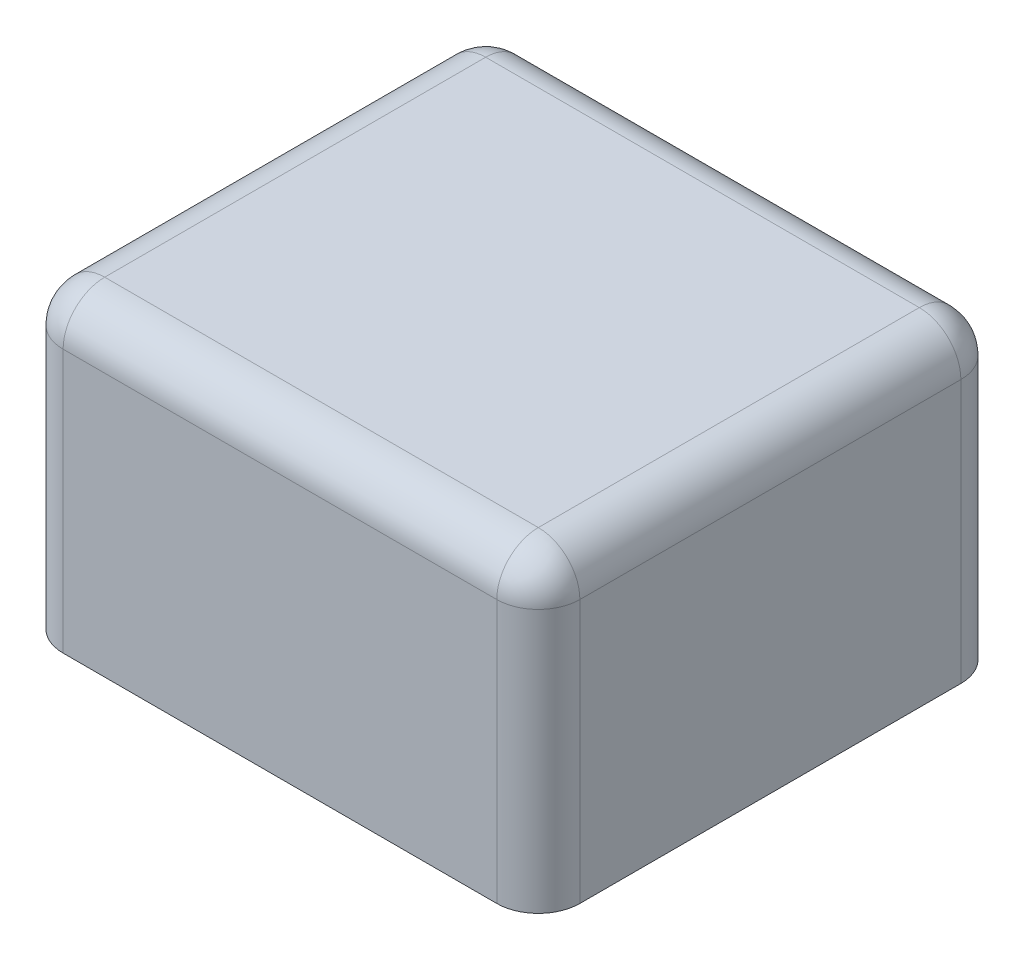
ISO-10303-21;
HEADER;
FILE_DESCRIPTION(('STEP AP214'),'2;1');
FILE_NAME('part.step','',(''),(''),'','','');
FILE_SCHEMA(('AUTOMOTIVE_DESIGN { 1 0 10303 214 1 1 1 1 }'));
ENDSEC;
DATA;
#1=APPLICATION_CONTEXT('core data for automotive mechanical design processes');
#2=APPLICATION_PROTOCOL_DEFINITION('international standard','automotive_design',2000,#1);
#3=PRODUCT_CONTEXT('',#1,'mechanical');
#4=PRODUCT('Part','Part','',(#3));
#5=PRODUCT_RELATED_PRODUCT_CATEGORY('part','',(#4));
#6=PRODUCT_DEFINITION_FORMATION('','',#4);
#7=PRODUCT_DEFINITION_CONTEXT('part definition',#1,'design');
#8=PRODUCT_DEFINITION('design','',#6,#7);
#9=PRODUCT_DEFINITION_SHAPE('','',#8);
#10=(LENGTH_UNIT() NAMED_UNIT(*) SI_UNIT(.MILLI.,.METRE.));
#11=(NAMED_UNIT(*) PLANE_ANGLE_UNIT() SI_UNIT($,.RADIAN.));
#12=(NAMED_UNIT(*) SI_UNIT($,.STERADIAN.) SOLID_ANGLE_UNIT());
#13=UNCERTAINTY_MEASURE_WITH_UNIT(LENGTH_MEASURE(1.E-05),#10,'distance_accuracy_value','');
#14=(GEOMETRIC_REPRESENTATION_CONTEXT(3) GLOBAL_UNCERTAINTY_ASSIGNED_CONTEXT((#13)) GLOBAL_UNIT_ASSIGNED_CONTEXT((#10,
#11,#12)) REPRESENTATION_CONTEXT('',''));
#15=CARTESIAN_POINT('',(0.,0.,0.));
#16=DIRECTION('',(0.,0.,1.));
#17=DIRECTION('',(1.,0.,0.));
#18=AXIS2_PLACEMENT_3D('',#15,#16,#17);
#19=CARTESIAN_POINT('',(18.65,22.,16.75));
#20=DIRECTION('',(-1.,0.,0.));
#21=DIRECTION('',(0.,0.,1.));
#22=AXIS2_PLACEMENT_3D('',#19,#20,#21);
#23=PLANE('',#22);
#24=DIRECTION('',(0.,0.,-1.));
#25=VECTOR('',#24,1.);
#26=CARTESIAN_POINT('',(18.65,0.,16.75));
#27=LINE('',#26,#25);
#28=CARTESIAN_POINT('',(18.65,0.,13.75));
#29=VERTEX_POINT('',#28);
#30=CARTESIAN_POINT('',(18.65,0.,-13.75));
#31=VERTEX_POINT('',#30);
#32=EDGE_CURVE('E142',#29,#31,#27,.T.);
#33=ORIENTED_EDGE('',*,*,#32,.T.);
#34=DIRECTION('',(0.,-1.,0.));
#35=VECTOR('',#34,1.);
#36=CARTESIAN_POINT('',(18.65,22.,-13.75));
#37=LINE('',#36,#35);
#38=CARTESIAN_POINT('',(18.65,19.,-13.75));
#39=VERTEX_POINT('',#38);
#40=EDGE_CURVE('E160',#31,#39,#37,.F.);
#41=ORIENTED_EDGE('',*,*,#40,.T.);
#42=DIRECTION('',(0.,0.,-1.));
#43=VECTOR('',#42,1.);
#44=CARTESIAN_POINT('',(18.65,19.,16.75));
#45=LINE('',#44,#43);
#46=CARTESIAN_POINT('',(18.65,19.,13.75));
#47=VERTEX_POINT('',#46);
#48=EDGE_CURVE('E156',#39,#47,#45,.F.);
#49=ORIENTED_EDGE('',*,*,#48,.T.);
#50=DIRECTION('',(0.,-1.,0.));
#51=VECTOR('',#50,1.);
#52=CARTESIAN_POINT('',(18.65,22.,13.75));
#53=LINE('',#52,#51);
#54=EDGE_CURVE('E158',#47,#29,#53,.T.);
#55=ORIENTED_EDGE('',*,*,#54,.T.);
#56=EDGE_LOOP('',(#33,#41,#49,#55));
#57=FACE_BOUND('',#56,.T.);
#58=ADVANCED_FACE('F33',(#57),#23,.F.);
#59=CARTESIAN_POINT('',(-18.65,22.,-16.75));
#60=DIRECTION('',(0.,0.,1.));
#61=DIRECTION('',(1.,0.,0.));
#62=AXIS2_PLACEMENT_3D('',#59,#60,#61);
#63=PLANE('',#62);
#64=DIRECTION('',(-1.,0.,0.));
#65=VECTOR('',#64,1.);
#66=CARTESIAN_POINT('',(-18.65,0.,-16.75));
#67=LINE('',#66,#65);
#68=CARTESIAN_POINT('',(15.65,0.,-16.75));
#69=VERTEX_POINT('',#68);
#70=CARTESIAN_POINT('',(-15.65,0.,-16.75));
#71=VERTEX_POINT('',#70);
#72=EDGE_CURVE('E138',#69,#71,#67,.T.);
#73=ORIENTED_EDGE('',*,*,#72,.T.);
#74=DIRECTION('',(0.,-1.,0.));
#75=VECTOR('',#74,1.);
#76=CARTESIAN_POINT('',(-15.65,22.,-16.75));
#77=LINE('',#76,#75);
#78=CARTESIAN_POINT('',(-15.65,19.,-16.75));
#79=VERTEX_POINT('',#78);
#80=EDGE_CURVE('E115',#71,#79,#77,.F.);
#81=ORIENTED_EDGE('',*,*,#80,.T.);
#82=DIRECTION('',(-1.,0.,0.));
#83=VECTOR('',#82,1.);
#84=CARTESIAN_POINT('',(-18.65,19.,-16.75));
#85=LINE('',#84,#83);
#86=CARTESIAN_POINT('',(15.65,19.,-16.75));
#87=VERTEX_POINT('',#86);
#88=EDGE_CURVE('E120',#79,#87,#85,.F.);
#89=ORIENTED_EDGE('',*,*,#88,.T.);
#90=DIRECTION('',(0.,-1.,0.));
#91=VECTOR('',#90,1.);
#92=CARTESIAN_POINT('',(15.65,22.,-16.75));
#93=LINE('',#92,#91);
#94=EDGE_CURVE('E153',#87,#69,#93,.T.);
#95=ORIENTED_EDGE('',*,*,#94,.T.);
#96=EDGE_LOOP('',(#73,#81,#89,#95));
#97=FACE_BOUND('',#96,.T.);
#98=ADVANCED_FACE('F249',(#97),#63,.F.);
#99=CARTESIAN_POINT('',(-18.65,22.,16.75));
#100=DIRECTION('',(1.,0.,0.));
#101=DIRECTION('',(0.,0.,-1.));
#102=AXIS2_PLACEMENT_3D('',#99,#100,#101);
#103=PLANE('',#102);
#104=DIRECTION('',(0.,0.,1.));
#105=VECTOR('',#104,1.);
#106=CARTESIAN_POINT('',(-18.65,19.,16.75));
#107=LINE('',#106,#105);
#108=CARTESIAN_POINT('',(-18.65,19.,13.75));
#109=VERTEX_POINT('',#108);
#110=CARTESIAN_POINT('',(-18.65,19.,-13.75));
#111=VERTEX_POINT('',#110);
#112=EDGE_CURVE('E129',#109,#111,#107,.F.);
#113=ORIENTED_EDGE('',*,*,#112,.T.);
#114=DIRECTION('',(0.,-1.,0.));
#115=VECTOR('',#114,1.);
#116=CARTESIAN_POINT('',(-18.65,22.,-13.75));
#117=LINE('',#116,#115);
#118=CARTESIAN_POINT('',(-18.65,0.,-13.75));
#119=VERTEX_POINT('',#118);
#120=EDGE_CURVE('E114',#111,#119,#117,.T.);
#121=ORIENTED_EDGE('',*,*,#120,.T.);
#122=DIRECTION('',(0.,0.,1.));
#123=VECTOR('',#122,1.);
#124=CARTESIAN_POINT('',(-18.65,0.,16.75));
#125=LINE('',#124,#123);
#126=CARTESIAN_POINT('',(-18.65,0.,13.75));
#127=VERTEX_POINT('',#126);
#128=EDGE_CURVE('E126',#119,#127,#125,.T.);
#129=ORIENTED_EDGE('',*,*,#128,.T.);
#130=DIRECTION('',(0.,-1.,0.));
#131=VECTOR('',#130,1.);
#132=CARTESIAN_POINT('',(-18.65,22.,13.75));
#133=LINE('',#132,#131);
#134=EDGE_CURVE('E132',#127,#109,#133,.F.);
#135=ORIENTED_EDGE('',*,*,#134,.T.);
#136=EDGE_LOOP('',(#113,#121,#129,#135));
#137=FACE_BOUND('',#136,.T.);
#138=ADVANCED_FACE('F125',(#137),#103,.F.);
#139=CARTESIAN_POINT('',(-18.65,22.,16.75));
#140=DIRECTION('',(0.,0.,-1.));
#141=DIRECTION('',(-1.,0.,0.));
#142=AXIS2_PLACEMENT_3D('',#139,#140,#141);
#143=PLANE('',#142);
#144=DIRECTION('',(1.,0.,0.));
#145=VECTOR('',#144,1.);
#146=CARTESIAN_POINT('',(-18.65,0.,16.75));
#147=LINE('',#146,#145);
#148=CARTESIAN_POINT('',(-15.65,0.,16.75));
#149=VERTEX_POINT('',#148);
#150=CARTESIAN_POINT('',(15.65,0.,16.75));
#151=VERTEX_POINT('',#150);
#152=EDGE_CURVE('E137',#149,#151,#147,.T.);
#153=ORIENTED_EDGE('',*,*,#152,.T.);
#154=DIRECTION('',(0.,-1.,0.));
#155=VECTOR('',#154,1.);
#156=CARTESIAN_POINT('',(15.65,22.,16.75));
#157=LINE('',#156,#155);
#158=CARTESIAN_POINT('',(15.65,19.,16.75));
#159=VERTEX_POINT('',#158);
#160=EDGE_CURVE('E166',#151,#159,#157,.F.);
#161=ORIENTED_EDGE('',*,*,#160,.T.);
#162=DIRECTION('',(1.,0.,0.));
#163=VECTOR('',#162,1.);
#164=CARTESIAN_POINT('',(-18.65,19.,16.75));
#165=LINE('',#164,#163);
#166=CARTESIAN_POINT('',(-15.65,19.,16.75));
#167=VERTEX_POINT('',#166);
#168=EDGE_CURVE('E162',#159,#167,#165,.F.);
#169=ORIENTED_EDGE('',*,*,#168,.T.);
#170=DIRECTION('',(0.,-1.,0.));
#171=VECTOR('',#170,1.);
#172=CARTESIAN_POINT('',(-15.65,22.,16.75));
#173=LINE('',#172,#171);
#174=EDGE_CURVE('E164',#167,#149,#173,.T.);
#175=ORIENTED_EDGE('',*,*,#174,.T.);
#176=EDGE_LOOP('',(#153,#161,#169,#175));
#177=FACE_BOUND('',#176,.T.);
#178=ADVANCED_FACE('F226',(#177),#143,.F.);
#179=CARTESIAN_POINT('',(0.,22.,0.));
#180=DIRECTION('',(0.,-1.,0.));
#181=DIRECTION('',(0.,0.,-1.));
#182=AXIS2_PLACEMENT_3D('',#179,#180,#181);
#183=PLANE('',#182);
#184=DIRECTION('',(0.,0.,-1.));
#185=VECTOR('',#184,1.);
#186=CARTESIAN_POINT('',(15.65,22.,0.));
#187=LINE('',#186,#185);
#188=CARTESIAN_POINT('',(15.65,22.,13.75));
#189=VERTEX_POINT('',#188);
#190=CARTESIAN_POINT('',(15.65,22.,-13.75));
#191=VERTEX_POINT('',#190);
#192=EDGE_CURVE('E42',#189,#191,#187,.T.);
#193=ORIENTED_EDGE('',*,*,#192,.T.);
#194=DIRECTION('',(-1.,0.,0.));
#195=VECTOR('',#194,1.);
#196=CARTESIAN_POINT('',(0.,22.,-13.75));
#197=LINE('',#196,#195);
#198=CARTESIAN_POINT('',(-15.65,22.,-13.75));
#199=VERTEX_POINT('',#198);
#200=EDGE_CURVE('E11',#191,#199,#197,.T.);
#201=ORIENTED_EDGE('',*,*,#200,.T.);
#202=DIRECTION('',(0.,0.,1.));
#203=VECTOR('',#202,1.);
#204=CARTESIAN_POINT('',(-15.65,22.,0.));
#205=LINE('',#204,#203);
#206=CARTESIAN_POINT('',(-15.65,22.,13.75));
#207=VERTEX_POINT('',#206);
#208=EDGE_CURVE('E168',#199,#207,#205,.T.);
#209=ORIENTED_EDGE('',*,*,#208,.T.);
#210=DIRECTION('',(1.,0.,0.));
#211=VECTOR('',#210,1.);
#212=CARTESIAN_POINT('',(0.,22.,13.75));
#213=LINE('',#212,#211);
#214=EDGE_CURVE('E53',#207,#189,#213,.T.);
#215=ORIENTED_EDGE('',*,*,#214,.T.);
#216=EDGE_LOOP('',(#193,#201,#209,#215));
#217=FACE_BOUND('',#216,.T.);
#218=ADVANCED_FACE('F288',(#217),#183,.F.);
#219=CARTESIAN_POINT('',(0.,0.,0.));
#220=DIRECTION('',(0.,-1.,0.));
#221=DIRECTION('',(0.,0.,-1.));
#222=AXIS2_PLACEMENT_3D('',#219,#220,#221);
#223=PLANE('',#222);
#224=ORIENTED_EDGE('',*,*,#128,.F.);
#225=CARTESIAN_POINT('',(-15.65,0.,-13.75));
#226=DIRECTION('',(0.,-1.,0.));
#227=DIRECTION('',(0.,0.,-1.));
#228=AXIS2_PLACEMENT_3D('',#225,#226,#227);
#229=CIRCLE('',#228,3.);
#230=EDGE_CURVE('E110',#119,#71,#229,.T.);
#231=ORIENTED_EDGE('',*,*,#230,.T.);
#232=ORIENTED_EDGE('',*,*,#72,.F.);
#233=CARTESIAN_POINT('',(15.65,0.,-13.75));
#234=DIRECTION('',(0.,-1.,0.));
#235=DIRECTION('',(0.,0.,-1.));
#236=AXIS2_PLACEMENT_3D('',#233,#234,#235);
#237=CIRCLE('',#236,3.);
#238=EDGE_CURVE('E121',#69,#31,#237,.T.);
#239=ORIENTED_EDGE('',*,*,#238,.T.);
#240=ORIENTED_EDGE('',*,*,#32,.F.);
#241=CARTESIAN_POINT('',(15.65,0.,13.75));
#242=DIRECTION('',(0.,-1.,0.));
#243=DIRECTION('',(0.,0.,-1.));
#244=AXIS2_PLACEMENT_3D('',#241,#242,#243);
#245=CIRCLE('',#244,3.);
#246=EDGE_CURVE('E149',#29,#151,#245,.T.);
#247=ORIENTED_EDGE('',*,*,#246,.T.);
#248=ORIENTED_EDGE('',*,*,#152,.F.);
#249=CARTESIAN_POINT('',(-15.65,0.,13.75));
#250=DIRECTION('',(0.,-1.,0.));
#251=DIRECTION('',(0.,0.,-1.));
#252=AXIS2_PLACEMENT_3D('',#249,#250,#251);
#253=CIRCLE('',#252,3.);
#254=EDGE_CURVE('E131',#149,#127,#253,.T.);
#255=ORIENTED_EDGE('',*,*,#254,.T.);
#256=EDGE_LOOP('',(#224,#231,#232,#239,#240,#247,#248,#255));
#257=FACE_BOUND('',#256,.T.);
#258=ADVANCED_FACE('F134',(#257),#223,.T.);
#259=CARTESIAN_POINT('',(15.65,22.,13.75));
#260=DIRECTION('',(0.,-1.,0.));
#261=DIRECTION('',(0.,0.,-1.));
#262=AXIS2_PLACEMENT_3D('',#259,#260,#261);
#263=CYLINDRICAL_SURFACE('',#262,3.);
#264=CARTESIAN_POINT('',(15.65,19.,13.75));
#265=DIRECTION('',(0.,1.,0.));
#266=DIRECTION('',(0.,0.,1.));
#267=AXIS2_PLACEMENT_3D('',#264,#265,#266);
#268=CIRCLE('',#267,3.);
#269=EDGE_CURVE('E37',#159,#47,#268,.T.);
#270=ORIENTED_EDGE('',*,*,#269,.F.);
#271=ORIENTED_EDGE('',*,*,#160,.F.);
#272=ORIENTED_EDGE('',*,*,#246,.F.);
#273=ORIENTED_EDGE('',*,*,#54,.F.);
#274=EDGE_LOOP('',(#270,#271,#272,#273));
#275=FACE_BOUND('',#274,.T.);
#276=ADVANCED_FACE('F35',(#275),#263,.T.);
#277=CARTESIAN_POINT('',(15.65,19.,13.75));
#278=DIRECTION('',(0.,0.,1.));
#279=DIRECTION('',(1.,0.,0.));
#280=AXIS2_PLACEMENT_3D('',#277,#278,#279);
#281=SPHERICAL_SURFACE('',#280,3.);
#282=CARTESIAN_POINT('',(15.65,19.,13.75));
#283=DIRECTION('',(1.,0.,0.));
#284=DIRECTION('',(0.,0.,-1.));
#285=AXIS2_PLACEMENT_3D('',#282,#283,#284);
#286=CIRCLE('',#285,3.);
#287=EDGE_CURVE('E197',#159,#189,#286,.F.);
#288=ORIENTED_EDGE('',*,*,#287,.F.);
#289=ORIENTED_EDGE('',*,*,#269,.T.);
#290=CARTESIAN_POINT('',(15.65,19.,13.75));
#291=DIRECTION('',(0.,0.,1.));
#292=DIRECTION('',(1.,0.,0.));
#293=AXIS2_PLACEMENT_3D('',#290,#291,#292);
#294=CIRCLE('',#293,3.);
#295=EDGE_CURVE('E198',#189,#47,#294,.F.);
#296=ORIENTED_EDGE('',*,*,#295,.F.);
#297=EDGE_LOOP('',(#288,#289,#296));
#298=FACE_BOUND('',#297,.T.);
#299=ADVANCED_FACE('F279',(#298),#281,.T.);
#300=CARTESIAN_POINT('',(15.65,22.,-13.75));
#301=DIRECTION('',(0.,-1.,0.));
#302=DIRECTION('',(0.,0.,-1.));
#303=AXIS2_PLACEMENT_3D('',#300,#301,#302);
#304=CYLINDRICAL_SURFACE('',#303,3.);
#305=ORIENTED_EDGE('',*,*,#238,.F.);
#306=ORIENTED_EDGE('',*,*,#94,.F.);
#307=CARTESIAN_POINT('',(15.65,19.,-13.75));
#308=DIRECTION('',(0.,1.,0.));
#309=DIRECTION('',(0.,0.,1.));
#310=AXIS2_PLACEMENT_3D('',#307,#308,#309);
#311=CIRCLE('',#310,3.);
#312=EDGE_CURVE('E194',#39,#87,#311,.T.);
#313=ORIENTED_EDGE('',*,*,#312,.F.);
#314=ORIENTED_EDGE('',*,*,#40,.F.);
#315=EDGE_LOOP('',(#305,#306,#313,#314));
#316=FACE_BOUND('',#315,.T.);
#317=ADVANCED_FACE('F216',(#316),#304,.T.);
#318=CARTESIAN_POINT('',(15.65,19.,0.));
#319=DIRECTION('',(0.,0.,-1.));
#320=DIRECTION('',(-1.,0.,0.));
#321=AXIS2_PLACEMENT_3D('',#318,#319,#320);
#322=CYLINDRICAL_SURFACE('',#321,3.);
#323=ORIENTED_EDGE('',*,*,#295,.T.);
#324=ORIENTED_EDGE('',*,*,#48,.F.);
#325=CARTESIAN_POINT('',(15.65,19.,-13.75));
#326=DIRECTION('',(0.,0.,-1.));
#327=DIRECTION('',(-1.,0.,0.));
#328=AXIS2_PLACEMENT_3D('',#325,#326,#327);
#329=CIRCLE('',#328,3.);
#330=EDGE_CURVE('E191',#191,#39,#329,.T.);
#331=ORIENTED_EDGE('',*,*,#330,.F.);
#332=ORIENTED_EDGE('',*,*,#192,.F.);
#333=EDGE_LOOP('',(#323,#324,#331,#332));
#334=FACE_BOUND('',#333,.T.);
#335=ADVANCED_FACE('F222',(#334),#322,.T.);
#336=CARTESIAN_POINT('',(0.,19.,13.75));
#337=DIRECTION('',(1.,0.,0.));
#338=DIRECTION('',(0.,0.,-1.));
#339=AXIS2_PLACEMENT_3D('',#336,#337,#338);
#340=CYLINDRICAL_SURFACE('',#339,3.);
#341=ORIENTED_EDGE('',*,*,#287,.T.);
#342=ORIENTED_EDGE('',*,*,#214,.F.);
#343=CARTESIAN_POINT('',(-15.65,19.,13.75));
#344=DIRECTION('',(-1.,0.,0.));
#345=DIRECTION('',(0.,0.,1.));
#346=AXIS2_PLACEMENT_3D('',#343,#344,#345);
#347=CIRCLE('',#346,3.);
#348=EDGE_CURVE('E188',#167,#207,#347,.T.);
#349=ORIENTED_EDGE('',*,*,#348,.F.);
#350=ORIENTED_EDGE('',*,*,#168,.F.);
#351=EDGE_LOOP('',(#341,#342,#349,#350));
#352=FACE_BOUND('',#351,.T.);
#353=ADVANCED_FACE('F235',(#352),#340,.T.);
#354=CARTESIAN_POINT('',(-15.65,22.,13.75));
#355=DIRECTION('',(0.,-1.,0.));
#356=DIRECTION('',(0.,0.,-1.));
#357=AXIS2_PLACEMENT_3D('',#354,#355,#356);
#358=CYLINDRICAL_SURFACE('',#357,3.);
#359=ORIENTED_EDGE('',*,*,#254,.F.);
#360=ORIENTED_EDGE('',*,*,#174,.F.);
#361=CARTESIAN_POINT('',(-15.65,19.,13.75));
#362=DIRECTION('',(0.,1.,0.));
#363=DIRECTION('',(0.,0.,1.));
#364=AXIS2_PLACEMENT_3D('',#361,#362,#363);
#365=CIRCLE('',#364,3.);
#366=EDGE_CURVE('E185',#109,#167,#365,.T.);
#367=ORIENTED_EDGE('',*,*,#366,.F.);
#368=ORIENTED_EDGE('',*,*,#134,.F.);
#369=EDGE_LOOP('',(#359,#360,#367,#368));
#370=FACE_BOUND('',#369,.T.);
#371=ADVANCED_FACE('F232',(#370),#358,.T.);
#372=CARTESIAN_POINT('',(15.65,19.,-13.75));
#373=DIRECTION('',(0.,0.,1.));
#374=DIRECTION('',(1.,0.,0.));
#375=AXIS2_PLACEMENT_3D('',#372,#373,#374);
#376=SPHERICAL_SURFACE('',#375,3.);
#377=ORIENTED_EDGE('',*,*,#330,.T.);
#378=ORIENTED_EDGE('',*,*,#312,.T.);
#379=CARTESIAN_POINT('',(15.65,19.,-13.75));
#380=DIRECTION('',(1.,0.,0.));
#381=DIRECTION('',(0.,1.,0.));
#382=AXIS2_PLACEMENT_3D('',#379,#380,#381);
#383=CIRCLE('',#382,3.);
#384=EDGE_CURVE('E182',#191,#87,#383,.F.);
#385=ORIENTED_EDGE('',*,*,#384,.F.);
#386=EDGE_LOOP('',(#377,#378,#385));
#387=FACE_BOUND('',#386,.T.);
#388=ADVANCED_FACE('F220',(#387),#376,.T.);
#389=CARTESIAN_POINT('',(-15.65,19.,13.75));
#390=DIRECTION('',(0.,0.,1.));
#391=DIRECTION('',(1.,0.,0.));
#392=AXIS2_PLACEMENT_3D('',#389,#390,#391);
#393=SPHERICAL_SURFACE('',#392,3.);
#394=ORIENTED_EDGE('',*,*,#366,.T.);
#395=ORIENTED_EDGE('',*,*,#348,.T.);
#396=CARTESIAN_POINT('',(-15.65,19.,13.75));
#397=DIRECTION('',(0.,0.,1.));
#398=DIRECTION('',(1.,0.,0.));
#399=AXIS2_PLACEMENT_3D('',#396,#397,#398);
#400=CIRCLE('',#399,3.);
#401=EDGE_CURVE('E179',#109,#207,#400,.F.);
#402=ORIENTED_EDGE('',*,*,#401,.F.);
#403=EDGE_LOOP('',(#394,#395,#402));
#404=FACE_BOUND('',#403,.T.);
#405=ADVANCED_FACE('F237',(#404),#393,.T.);
#406=CARTESIAN_POINT('',(0.,19.,-13.75));
#407=DIRECTION('',(-1.,0.,0.));
#408=DIRECTION('',(0.,0.,1.));
#409=AXIS2_PLACEMENT_3D('',#406,#407,#408);
#410=CYLINDRICAL_SURFACE('',#409,3.);
#411=ORIENTED_EDGE('',*,*,#384,.T.);
#412=ORIENTED_EDGE('',*,*,#88,.F.);
#413=CARTESIAN_POINT('',(-15.65,19.,-13.75));
#414=DIRECTION('',(-1.,0.,0.));
#415=DIRECTION('',(0.,0.,1.));
#416=AXIS2_PLACEMENT_3D('',#413,#414,#415);
#417=CIRCLE('',#416,3.);
#418=EDGE_CURVE('E176',#199,#79,#417,.T.);
#419=ORIENTED_EDGE('',*,*,#418,.F.);
#420=ORIENTED_EDGE('',*,*,#200,.F.);
#421=EDGE_LOOP('',(#411,#412,#419,#420));
#422=FACE_BOUND('',#421,.T.);
#423=ADVANCED_FACE('F247',(#422),#410,.T.);
#424=CARTESIAN_POINT('',(-15.65,19.,0.));
#425=DIRECTION('',(0.,0.,1.));
#426=DIRECTION('',(1.,0.,0.));
#427=AXIS2_PLACEMENT_3D('',#424,#425,#426);
#428=CYLINDRICAL_SURFACE('',#427,3.);
#429=ORIENTED_EDGE('',*,*,#401,.T.);
#430=ORIENTED_EDGE('',*,*,#208,.F.);
#431=CARTESIAN_POINT('',(-15.65,19.,-13.75));
#432=DIRECTION('',(0.,0.,-1.));
#433=DIRECTION('',(-1.,0.,0.));
#434=AXIS2_PLACEMENT_3D('',#431,#432,#433);
#435=CIRCLE('',#434,3.);
#436=EDGE_CURVE('E174',#111,#199,#435,.T.);
#437=ORIENTED_EDGE('',*,*,#436,.F.);
#438=ORIENTED_EDGE('',*,*,#112,.F.);
#439=EDGE_LOOP('',(#429,#430,#437,#438));
#440=FACE_BOUND('',#439,.T.);
#441=ADVANCED_FACE('F240',(#440),#428,.T.);
#442=CARTESIAN_POINT('',(-15.65,19.,-13.75));
#443=DIRECTION('',(0.,0.,1.));
#444=DIRECTION('',(1.,0.,0.));
#445=AXIS2_PLACEMENT_3D('',#442,#443,#444);
#446=SPHERICAL_SURFACE('',#445,3.);
#447=ORIENTED_EDGE('',*,*,#436,.T.);
#448=ORIENTED_EDGE('',*,*,#418,.T.);
#449=CARTESIAN_POINT('',(-15.65,19.,-13.75));
#450=DIRECTION('',(0.,1.,0.));
#451=DIRECTION('',(0.,0.,1.));
#452=AXIS2_PLACEMENT_3D('',#449,#450,#451);
#453=CIRCLE('',#452,3.);
#454=EDGE_CURVE('E172',#111,#79,#453,.F.);
#455=ORIENTED_EDGE('',*,*,#454,.F.);
#456=EDGE_LOOP('',(#447,#448,#455));
#457=FACE_BOUND('',#456,.T.);
#458=ADVANCED_FACE('F244',(#457),#446,.T.);
#459=CARTESIAN_POINT('',(-15.65,22.,-13.75));
#460=DIRECTION('',(0.,-1.,0.));
#461=DIRECTION('',(0.,0.,-1.));
#462=AXIS2_PLACEMENT_3D('',#459,#460,#461);
#463=CYLINDRICAL_SURFACE('',#462,3.);
#464=ORIENTED_EDGE('',*,*,#454,.T.);
#465=ORIENTED_EDGE('',*,*,#80,.F.);
#466=ORIENTED_EDGE('',*,*,#230,.F.);
#467=ORIENTED_EDGE('',*,*,#120,.F.);
#468=EDGE_LOOP('',(#464,#465,#466,#467));
#469=FACE_BOUND('',#468,.T.);
#470=ADVANCED_FACE('F113',(#469),#463,.T.);
#471=CLOSED_SHELL('',(#58,#98,#138,#178,#218,#258,#276,#299,#317,#335,#353,#371,#388,#405,#423,
#441,#458,#470));
#472=MANIFOLD_SOLID_BREP('B2',#471);
#473=ADVANCED_BREP_SHAPE_REPRESENTATION('',(#18,#472),#14);
#474=SHAPE_DEFINITION_REPRESENTATION(#9,#473);
ENDSEC;
END-ISO-10303-21;
